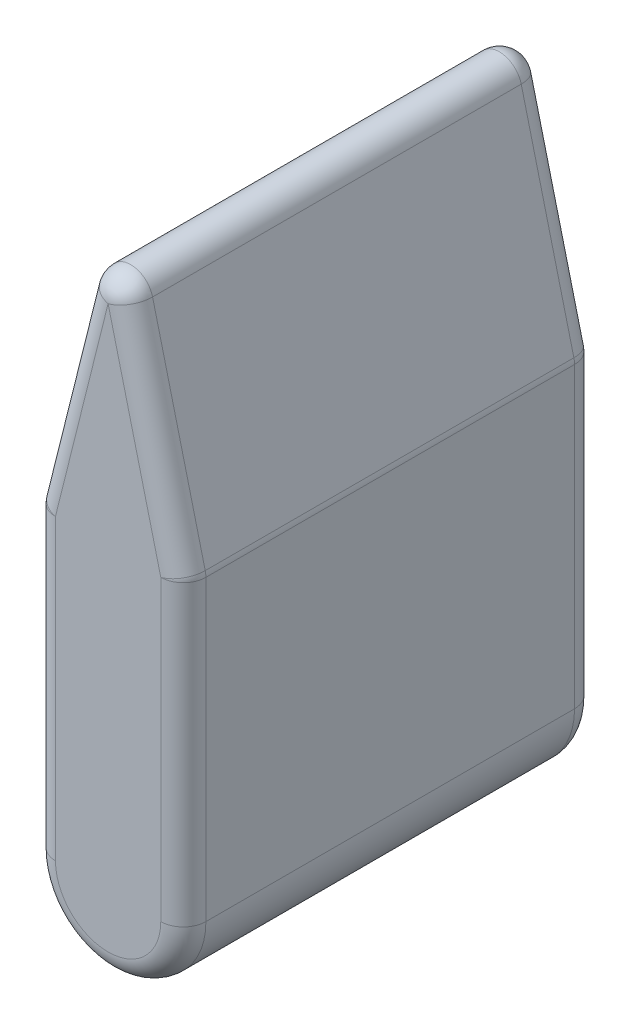
ISO-10303-21;
HEADER;
FILE_DESCRIPTION(('STEP AP214'),'2;1');
FILE_NAME('part.step','',(''),(''),'','','');
FILE_SCHEMA(('AUTOMOTIVE_DESIGN { 1 0 10303 214 1 1 1 1 }'));
ENDSEC;
DATA;
#1=APPLICATION_CONTEXT('core data for automotive mechanical design processes');
#2=APPLICATION_PROTOCOL_DEFINITION('international standard','automotive_design',2000,#1);
#3=PRODUCT_CONTEXT('',#1,'mechanical');
#4=PRODUCT('Part','Part','',(#3));
#5=PRODUCT_RELATED_PRODUCT_CATEGORY('part','',(#4));
#6=PRODUCT_DEFINITION_FORMATION('','',#4);
#7=PRODUCT_DEFINITION_CONTEXT('part definition',#1,'design');
#8=PRODUCT_DEFINITION('design','',#6,#7);
#9=PRODUCT_DEFINITION_SHAPE('','',#8);
#10=(LENGTH_UNIT() NAMED_UNIT(*) SI_UNIT(.MILLI.,.METRE.));
#11=(NAMED_UNIT(*) PLANE_ANGLE_UNIT() SI_UNIT($,.RADIAN.));
#12=(NAMED_UNIT(*) SI_UNIT($,.STERADIAN.) SOLID_ANGLE_UNIT());
#13=UNCERTAINTY_MEASURE_WITH_UNIT(LENGTH_MEASURE(1.E-05),#10,'distance_accuracy_value','');
#14=(GEOMETRIC_REPRESENTATION_CONTEXT(3) GLOBAL_UNCERTAINTY_ASSIGNED_CONTEXT((#13)) GLOBAL_UNIT_ASSIGNED_CONTEXT((#10,
#11,#12)) REPRESENTATION_CONTEXT('',''));
#15=CARTESIAN_POINT('',(0.,0.,0.));
#16=DIRECTION('',(0.,0.,1.));
#17=DIRECTION('',(1.,0.,0.));
#18=AXIS2_PLACEMENT_3D('',#15,#16,#17);
#19=CARTESIAN_POINT('',(0.,0.,27.5));
#20=DIRECTION('',(0.,0.,-1.));
#21=DIRECTION('',(-1.,0.,0.));
#22=AXIS2_PLACEMENT_3D('',#19,#20,#21);
#23=CYLINDRICAL_SURFACE('',#22,10.);
#24=DIRECTION('',(0.,0.,-1.));
#25=VECTOR('',#24,1.);
#26=CARTESIAN_POINT('',(-10.,0.,27.5));
#27=LINE('',#26,#25);
#28=CARTESIAN_POINT('',(-10.,0.,24.5));
#29=VERTEX_POINT('',#28);
#30=CARTESIAN_POINT('',(-10.,0.,-24.5));
#31=VERTEX_POINT('',#30);
#32=EDGE_CURVE('E163',#29,#31,#27,.T.);
#33=ORIENTED_EDGE('',*,*,#32,.T.);
#34=CARTESIAN_POINT('',(0.,0.,-24.5));
#35=DIRECTION('',(0.,0.,1.));
#36=DIRECTION('',(1.,0.,0.));
#37=AXIS2_PLACEMENT_3D('',#34,#35,#36);
#38=CIRCLE('',#37,10.);
#39=CARTESIAN_POINT('',(10.,0.,-24.5));
#40=VERTEX_POINT('',#39);
#41=EDGE_CURVE('E161',#31,#40,#38,.T.);
#42=ORIENTED_EDGE('',*,*,#41,.T.);
#43=DIRECTION('',(0.,0.,-1.));
#44=VECTOR('',#43,1.);
#45=CARTESIAN_POINT('',(10.,0.,27.5));
#46=LINE('',#45,#44);
#47=CARTESIAN_POINT('',(10.,0.,24.5));
#48=VERTEX_POINT('',#47);
#49=EDGE_CURVE('E144',#48,#40,#46,.T.);
#50=ORIENTED_EDGE('',*,*,#49,.F.);
#51=CARTESIAN_POINT('',(0.,0.,24.5));
#52=DIRECTION('',(0.,0.,1.));
#53=DIRECTION('',(1.,0.,0.));
#54=AXIS2_PLACEMENT_3D('',#51,#52,#53);
#55=CIRCLE('',#54,10.);
#56=EDGE_CURVE('E158',#48,#29,#55,.F.);
#57=ORIENTED_EDGE('',*,*,#56,.T.);
#58=EDGE_LOOP('',(#33,#42,#50,#57));
#59=FACE_BOUND('',#58,.T.);
#60=ADVANCED_FACE('F45',(#59),#23,.T.);
#61=CARTESIAN_POINT('',(9.99999999999999,40.,27.5));
#62=DIRECTION('',(-1.,0.,0.));
#63=DIRECTION('',(0.,-1.,0.));
#64=AXIS2_PLACEMENT_3D('',#61,#62,#63);
#65=PLANE('',#64);
#66=ORIENTED_EDGE('',*,*,#49,.T.);
#67=DIRECTION('',(0.,1.,0.));
#68=VECTOR('',#67,1.);
#69=CARTESIAN_POINT('',(9.99999999999999,40.,-24.5));
#70=LINE('',#69,#68);
#71=CARTESIAN_POINT('',(9.99999999999999,39.630683123147,-24.5));
#72=VERTEX_POINT('',#71);
#73=EDGE_CURVE('E153',#40,#72,#70,.T.);
#74=ORIENTED_EDGE('',*,*,#73,.T.);
#75=DIRECTION('',(0.,0.,-1.));
#76=VECTOR('',#75,1.);
#77=CARTESIAN_POINT('',(9.99999999999999,39.630683123147,27.5));
#78=LINE('',#77,#76);
#79=CARTESIAN_POINT('',(9.99999999999999,39.630683123147,24.5));
#80=VERTEX_POINT('',#79);
#81=EDGE_CURVE('E147',#72,#80,#78,.F.);
#82=ORIENTED_EDGE('',*,*,#81,.T.);
#83=DIRECTION('',(0.,1.,0.));
#84=VECTOR('',#83,1.);
#85=CARTESIAN_POINT('',(10.,0.,24.5));
#86=LINE('',#85,#84);
#87=EDGE_CURVE('E140',#80,#48,#86,.F.);
#88=ORIENTED_EDGE('',*,*,#87,.T.);
#89=EDGE_LOOP('',(#66,#74,#82,#88));
#90=FACE_BOUND('',#89,.T.);
#91=ADVANCED_FACE('F142',(#90),#65,.F.);
#92=CARTESIAN_POINT('',(0.,80.,27.5));
#93=DIRECTION('',(-0.970142500145332,-0.242535625036333,0.));
#94=DIRECTION('',(0.242535625036333,-0.970142500145332,0.));
#95=AXIS2_PLACEMENT_3D('',#92,#93,#94);
#96=PLANE('',#95);
#97=DIRECTION('',(-0.242535625036333,0.970142500145332,0.));
#98=VECTOR('',#97,1.);
#99=CARTESIAN_POINT('',(9.99999999999999,40.,24.5));
#100=LINE('',#99,#98);
#101=CARTESIAN_POINT('',(2.91042750043599,68.358289998256,24.5));
#102=VERTEX_POINT('',#101);
#103=CARTESIAN_POINT('',(9.91042750043599,40.358289998256,24.5));
#104=VERTEX_POINT('',#103);
#105=EDGE_CURVE('E232',#102,#104,#100,.F.);
#106=ORIENTED_EDGE('',*,*,#105,.T.);
#107=DIRECTION('',(0.,0.,-1.));
#108=VECTOR('',#107,1.);
#109=CARTESIAN_POINT('',(9.91042750043599,40.358289998256,27.5));
#110=LINE('',#109,#108);
#111=CARTESIAN_POINT('',(9.91042750043599,40.358289998256,-24.5));
#112=VERTEX_POINT('',#111);
#113=EDGE_CURVE('E239',#104,#112,#110,.T.);
#114=ORIENTED_EDGE('',*,*,#113,.T.);
#115=DIRECTION('',(-0.242535625036333,0.970142500145332,0.));
#116=VECTOR('',#115,1.);
#117=CARTESIAN_POINT('',(0.,80.,-24.5));
#118=LINE('',#117,#116);
#119=CARTESIAN_POINT('',(2.91042750043599,68.358289998256,-24.5));
#120=VERTEX_POINT('',#119);
#121=EDGE_CURVE('E235',#112,#120,#118,.T.);
#122=ORIENTED_EDGE('',*,*,#121,.T.);
#123=DIRECTION('',(0.,0.,-1.));
#124=VECTOR('',#123,1.);
#125=CARTESIAN_POINT('',(2.91042750043599,68.358289998256,27.5));
#126=LINE('',#125,#124);
#127=EDGE_CURVE('E229',#120,#102,#126,.F.);
#128=ORIENTED_EDGE('',*,*,#127,.T.);
#129=EDGE_LOOP('',(#106,#114,#122,#128));
#130=FACE_BOUND('',#129,.T.);
#131=ADVANCED_FACE('F342',(#130),#96,.F.);
#132=CARTESIAN_POINT('',(-10.,40.,27.5));
#133=DIRECTION('',(0.970142500145332,-0.242535625036333,0.));
#134=DIRECTION('',(0.242535625036333,0.970142500145332,0.));
#135=AXIS2_PLACEMENT_3D('',#132,#133,#134);
#136=PLANE('',#135);
#137=DIRECTION('',(-0.242535625036333,-0.970142500145332,0.));
#138=VECTOR('',#137,1.);
#139=CARTESIAN_POINT('',(-10.,40.,-24.5));
#140=LINE('',#139,#138);
#141=CARTESIAN_POINT('',(-2.910427500436,68.358289998256,-24.5));
#142=VERTEX_POINT('',#141);
#143=CARTESIAN_POINT('',(-9.91042750043601,40.358289998256,-24.5));
#144=VERTEX_POINT('',#143);
#145=EDGE_CURVE('E248',#142,#144,#140,.T.);
#146=ORIENTED_EDGE('',*,*,#145,.T.);
#147=DIRECTION('',(0.,0.,-1.));
#148=VECTOR('',#147,1.);
#149=CARTESIAN_POINT('',(-9.91042750043601,40.358289998256,27.5));
#150=LINE('',#149,#148);
#151=CARTESIAN_POINT('',(-9.91042750043601,40.358289998256,24.5));
#152=VERTEX_POINT('',#151);
#153=EDGE_CURVE('E252',#144,#152,#150,.F.);
#154=ORIENTED_EDGE('',*,*,#153,.T.);
#155=DIRECTION('',(-0.242535625036333,-0.970142500145332,0.));
#156=VECTOR('',#155,1.);
#157=CARTESIAN_POINT('',(0.,80.,24.5));
#158=LINE('',#157,#156);
#159=CARTESIAN_POINT('',(-2.910427500436,68.358289998256,24.5));
#160=VERTEX_POINT('',#159);
#161=EDGE_CURVE('E245',#152,#160,#158,.F.);
#162=ORIENTED_EDGE('',*,*,#161,.T.);
#163=DIRECTION('',(0.,0.,-1.));
#164=VECTOR('',#163,1.);
#165=CARTESIAN_POINT('',(-2.910427500436,68.358289998256,27.5));
#166=LINE('',#165,#164);
#167=EDGE_CURVE('E242',#160,#142,#166,.T.);
#168=ORIENTED_EDGE('',*,*,#167,.T.);
#169=EDGE_LOOP('',(#146,#154,#162,#168));
#170=FACE_BOUND('',#169,.T.);
#171=ADVANCED_FACE('F552',(#170),#136,.F.);
#172=CARTESIAN_POINT('',(-10.,0.,27.5));
#173=DIRECTION('',(1.,0.,0.));
#174=DIRECTION('',(0.,1.,0.));
#175=AXIS2_PLACEMENT_3D('',#172,#173,#174);
#176=PLANE('',#175);
#177=DIRECTION('',(0.,0.,-1.));
#178=VECTOR('',#177,1.);
#179=CARTESIAN_POINT('',(-10.,39.630683123147,27.5));
#180=LINE('',#179,#178);
#181=CARTESIAN_POINT('',(-10.,39.630683123147,24.5));
#182=VERTEX_POINT('',#181);
#183=CARTESIAN_POINT('',(-10.,39.630683123147,-24.5));
#184=VERTEX_POINT('',#183);
#185=EDGE_CURVE('E255',#182,#184,#180,.T.);
#186=ORIENTED_EDGE('',*,*,#185,.T.);
#187=DIRECTION('',(0.,-1.,0.));
#188=VECTOR('',#187,1.);
#189=CARTESIAN_POINT('',(-10.,0.,-24.5));
#190=LINE('',#189,#188);
#191=EDGE_CURVE('E174',#184,#31,#190,.T.);
#192=ORIENTED_EDGE('',*,*,#191,.T.);
#193=ORIENTED_EDGE('',*,*,#32,.F.);
#194=DIRECTION('',(0.,-1.,0.));
#195=VECTOR('',#194,1.);
#196=CARTESIAN_POINT('',(-10.,40.,24.5));
#197=LINE('',#196,#195);
#198=EDGE_CURVE('E258',#29,#182,#197,.F.);
#199=ORIENTED_EDGE('',*,*,#198,.T.);
#200=EDGE_LOOP('',(#186,#192,#193,#199));
#201=FACE_BOUND('',#200,.T.);
#202=ADVANCED_FACE('F544',(#201),#176,.F.);
#203=CARTESIAN_POINT('',(0.,0.,27.5));
#204=DIRECTION('',(0.,0.,1.));
#205=DIRECTION('',(1.,0.,0.));
#206=AXIS2_PLACEMENT_3D('',#203,#204,#205);
#207=PLANE('',#206);
#208=DIRECTION('',(-0.242535625036333,-0.970142500145332,0.));
#209=VECTOR('',#208,1.);
#210=CARTESIAN_POINT('',(-7.08957249956401,39.272393124891,27.5));
#211=LINE('',#210,#209);
#212=CARTESIAN_POINT('',(0.,67.630683123147,27.5));
#213=VERTEX_POINT('',#212);
#214=CARTESIAN_POINT('',(-7.00000000000001,39.630683123147,27.5));
#215=VERTEX_POINT('',#214);
#216=EDGE_CURVE('E55',#213,#215,#211,.T.);
#217=ORIENTED_EDGE('',*,*,#216,.T.);
#218=DIRECTION('',(0.,-1.,0.));
#219=VECTOR('',#218,1.);
#220=CARTESIAN_POINT('',(-7.,0.,27.5));
#221=LINE('',#220,#219);
#222=CARTESIAN_POINT('',(-7.,0.,27.5));
#223=VERTEX_POINT('',#222);
#224=EDGE_CURVE('E11',#215,#223,#221,.T.);
#225=ORIENTED_EDGE('',*,*,#224,.T.);
#226=CARTESIAN_POINT('',(0.,0.,27.5));
#227=DIRECTION('',(0.,0.,1.));
#228=DIRECTION('',(1.,0.,0.));
#229=AXIS2_PLACEMENT_3D('',#226,#227,#228);
#230=CIRCLE('',#229,7.);
#231=CARTESIAN_POINT('',(7.,0.,27.5));
#232=VERTEX_POINT('',#231);
#233=EDGE_CURVE('E265',#223,#232,#230,.T.);
#234=ORIENTED_EDGE('',*,*,#233,.T.);
#235=DIRECTION('',(0.,1.,0.));
#236=VECTOR('',#235,1.);
#237=CARTESIAN_POINT('',(6.99999999999999,40.,27.5));
#238=LINE('',#237,#236);
#239=CARTESIAN_POINT('',(6.99999999999999,39.630683123147,27.5));
#240=VERTEX_POINT('',#239);
#241=EDGE_CURVE('E177',#232,#240,#238,.T.);
#242=ORIENTED_EDGE('',*,*,#241,.T.);
#243=DIRECTION('',(-0.242535625036333,0.970142500145332,0.));
#244=VECTOR('',#243,1.);
#245=CARTESIAN_POINT('',(-2.910427500436,79.272393124891,27.5));
#246=LINE('',#245,#244);
#247=EDGE_CURVE('E66',#240,#213,#246,.T.);
#248=ORIENTED_EDGE('',*,*,#247,.T.);
#249=EDGE_LOOP('',(#217,#225,#234,#242,#248));
#250=FACE_BOUND('',#249,.T.);
#251=ADVANCED_FACE('F536',(#250),#207,.T.);
#252=CARTESIAN_POINT('',(0.,0.,-27.5));
#253=DIRECTION('',(0.,0.,1.));
#254=DIRECTION('',(1.,0.,0.));
#255=AXIS2_PLACEMENT_3D('',#252,#253,#254);
#256=PLANE('',#255);
#257=DIRECTION('',(-0.242535625036333,0.970142500145332,0.));
#258=VECTOR('',#257,1.);
#259=CARTESIAN_POINT('',(15.9131019113287,3.97827547783217,-27.5));
#260=LINE('',#259,#258);
#261=CARTESIAN_POINT('',(0.,67.630683123147,-27.5));
#262=VERTEX_POINT('',#261);
#263=CARTESIAN_POINT('',(7.,39.630683123147,-27.5));
#264=VERTEX_POINT('',#263);
#265=EDGE_CURVE('E222',#262,#264,#260,.F.);
#266=ORIENTED_EDGE('',*,*,#265,.T.);
#267=DIRECTION('',(0.,1.,0.));
#268=VECTOR('',#267,1.);
#269=CARTESIAN_POINT('',(7.,0.,-27.5));
#270=LINE('',#269,#268);
#271=CARTESIAN_POINT('',(7.,0.,-27.5));
#272=VERTEX_POINT('',#271);
#273=EDGE_CURVE('E225',#264,#272,#270,.F.);
#274=ORIENTED_EDGE('',*,*,#273,.T.);
#275=CARTESIAN_POINT('',(0.,0.,-27.5));
#276=DIRECTION('',(0.,0.,1.));
#277=DIRECTION('',(1.,0.,0.));
#278=AXIS2_PLACEMENT_3D('',#275,#276,#277);
#279=CIRCLE('',#278,7.);
#280=CARTESIAN_POINT('',(-7.,0.,-27.5));
#281=VERTEX_POINT('',#280);
#282=EDGE_CURVE('E213',#272,#281,#279,.F.);
#283=ORIENTED_EDGE('',*,*,#282,.T.);
#284=DIRECTION('',(0.,-1.,0.));
#285=VECTOR('',#284,1.);
#286=CARTESIAN_POINT('',(-7.,0.,-27.5));
#287=LINE('',#286,#285);
#288=CARTESIAN_POINT('',(-7.00000000000001,39.630683123147,-27.5));
#289=VERTEX_POINT('',#288);
#290=EDGE_CURVE('E216',#281,#289,#287,.F.);
#291=ORIENTED_EDGE('',*,*,#290,.T.);
#292=DIRECTION('',(-0.242535625036333,-0.970142500145332,0.));
#293=VECTOR('',#292,1.);
#294=CARTESIAN_POINT('',(-15.9131019113287,3.97827547783219,-27.5));
#295=LINE('',#294,#293);
#296=EDGE_CURVE('E219',#289,#262,#295,.F.);
#297=ORIENTED_EDGE('',*,*,#296,.T.);
#298=EDGE_LOOP('',(#266,#274,#283,#291,#297));
#299=FACE_BOUND('',#298,.T.);
#300=ADVANCED_FACE('F362',(#299),#256,.F.);
#301=CARTESIAN_POINT('',(-7.,0.,24.5));
#302=DIRECTION('',(0.,1.,0.));
#303=DIRECTION('',(-1.,0.,0.));
#304=AXIS2_PLACEMENT_3D('',#301,#302,#303);
#305=CYLINDRICAL_SURFACE('',#304,3.);
#306=CARTESIAN_POINT('',(-7.,0.,24.5));
#307=DIRECTION('',(0.,-1.,0.));
#308=DIRECTION('',(1.,0.,0.));
#309=AXIS2_PLACEMENT_3D('',#306,#307,#308);
#310=CIRCLE('',#309,3.);
#311=EDGE_CURVE('E172',#223,#29,#310,.T.);
#312=ORIENTED_EDGE('',*,*,#311,.F.);
#313=ORIENTED_EDGE('',*,*,#224,.F.);
#314=CARTESIAN_POINT('',(-7.00000000000001,39.630683123147,24.5));
#315=DIRECTION('',(0.,1.,0.));
#316=DIRECTION('',(0.,0.,1.));
#317=AXIS2_PLACEMENT_3D('',#314,#315,#316);
#318=CIRCLE('',#317,3.);
#319=EDGE_CURVE('E196',#182,#215,#318,.T.);
#320=ORIENTED_EDGE('',*,*,#319,.F.);
#321=ORIENTED_EDGE('',*,*,#198,.F.);
#322=EDGE_LOOP('',(#312,#313,#320,#321));
#323=FACE_BOUND('',#322,.T.);
#324=ADVANCED_FACE('F47',(#323),#305,.T.);
#325=CARTESIAN_POINT('',(-15.9131019113287,3.97827547783219,24.5));
#326=DIRECTION('',(0.242535625036333,0.970142500145332,0.));
#327=DIRECTION('',(-0.970142500145332,0.242535625036333,0.));
#328=AXIS2_PLACEMENT_3D('',#325,#326,#327);
#329=CYLINDRICAL_SURFACE('',#328,3.);
#330=CARTESIAN_POINT('',(-7.00000000000001,39.630683123147,24.5));
#331=DIRECTION('',(-0.242535625036333,-0.970142500145332,0.));
#332=DIRECTION('',(0.970142500145332,-0.242535625036333,0.));
#333=AXIS2_PLACEMENT_3D('',#330,#331,#332);
#334=CIRCLE('',#333,3.);
#335=EDGE_CURVE('E49',#215,#152,#334,.T.);
#336=ORIENTED_EDGE('',*,*,#335,.F.);
#337=ORIENTED_EDGE('',*,*,#216,.F.);
#338=CARTESIAN_POINT('',(0.,67.630683123147,24.5));
#339=DIRECTION('',(0.242535625036335,0.970142500145331,0.));
#340=DIRECTION('',(-0.970142500145332,0.242535625036335,0.));
#341=AXIS2_PLACEMENT_3D('',#338,#339,#340);
#342=CIRCLE('',#341,3.);
#343=EDGE_CURVE('E185',#160,#213,#342,.T.);
#344=ORIENTED_EDGE('',*,*,#343,.F.);
#345=ORIENTED_EDGE('',*,*,#161,.F.);
#346=EDGE_LOOP('',(#336,#337,#344,#345));
#347=FACE_BOUND('',#346,.T.);
#348=ADVANCED_FACE('F514',(#347),#329,.T.);
#349=CARTESIAN_POINT('',(-7.00000000000001,39.630683123147,24.5));
#350=DIRECTION('',(0.,0.,1.));
#351=DIRECTION('',(0.,-1.,0.));
#352=AXIS2_PLACEMENT_3D('',#349,#350,#351);
#353=SPHERICAL_SURFACE('',#352,3.);
#354=ORIENTED_EDGE('',*,*,#319,.T.);
#355=ORIENTED_EDGE('',*,*,#335,.T.);
#356=CARTESIAN_POINT('',(-7.00000000000001,39.630683123147,24.5));
#357=DIRECTION('',(0.,0.,1.));
#358=DIRECTION('',(1.,0.,0.));
#359=AXIS2_PLACEMENT_3D('',#356,#357,#358);
#360=CIRCLE('',#359,3.);
#361=EDGE_CURVE('E179',#182,#152,#360,.F.);
#362=ORIENTED_EDGE('',*,*,#361,.F.);
#363=EDGE_LOOP('',(#354,#355,#362));
#364=FACE_BOUND('',#363,.T.);
#365=ADVANCED_FACE('F506',(#364),#353,.T.);
#366=CARTESIAN_POINT('',(0.,0.,24.5));
#367=DIRECTION('',(0.,0.,1.));
#368=DIRECTION('',(1.,0.,0.));
#369=AXIS2_PLACEMENT_3D('',#366,#367,#368);
#370=TOROIDAL_SURFACE('',#369,7.,3.);
#371=ORIENTED_EDGE('',*,*,#311,.T.);
#372=ORIENTED_EDGE('',*,*,#56,.F.);
#373=CARTESIAN_POINT('',(7.,0.,24.5));
#374=DIRECTION('',(0.,1.,0.));
#375=DIRECTION('',(-1.,0.,0.));
#376=AXIS2_PLACEMENT_3D('',#373,#374,#375);
#377=CIRCLE('',#376,3.);
#378=EDGE_CURVE('E169',#232,#48,#377,.T.);
#379=ORIENTED_EDGE('',*,*,#378,.F.);
#380=ORIENTED_EDGE('',*,*,#233,.F.);
#381=EDGE_LOOP('',(#371,#372,#379,#380));
#382=FACE_BOUND('',#381,.T.);
#383=ADVANCED_FACE('F168',(#382),#370,.T.);
#384=CARTESIAN_POINT('',(0.,67.630683123147,24.5));
#385=DIRECTION('',(0.,0.,1.));
#386=DIRECTION('',(1.,0.,0.));
#387=AXIS2_PLACEMENT_3D('',#384,#385,#386);
#388=SPHERICAL_SURFACE('',#387,3.);
#389=CARTESIAN_POINT('',(0.,67.630683123147,24.5));
#390=DIRECTION('',(0.,0.,1.));
#391=DIRECTION('',(1.,0.,0.));
#392=AXIS2_PLACEMENT_3D('',#389,#390,#391);
#393=CIRCLE('',#392,3.);
#394=EDGE_CURVE('E188',#160,#102,#393,.F.);
#395=ORIENTED_EDGE('',*,*,#394,.F.);
#396=ORIENTED_EDGE('',*,*,#343,.T.);
#397=CARTESIAN_POINT('',(0.,67.630683123147,24.5));
#398=DIRECTION('',(-0.242535625036335,0.970142500145331,0.));
#399=DIRECTION('',(-0.970142500145332,-0.242535625036335,0.));
#400=AXIS2_PLACEMENT_3D('',#397,#398,#399);
#401=CIRCLE('',#400,3.);
#402=EDGE_CURVE('E180',#102,#213,#401,.F.);
#403=ORIENTED_EDGE('',*,*,#402,.F.);
#404=EDGE_LOOP('',(#395,#396,#403));
#405=FACE_BOUND('',#404,.T.);
#406=ADVANCED_FACE('F335',(#405),#388,.T.);
#407=CARTESIAN_POINT('',(-7.00000000000001,39.630683123147,27.5));
#408=DIRECTION('',(0.,0.,-1.));
#409=DIRECTION('',(-1.,0.,0.));
#410=AXIS2_PLACEMENT_3D('',#407,#408,#409);
#411=CYLINDRICAL_SURFACE('',#410,3.);
#412=ORIENTED_EDGE('',*,*,#361,.T.);
#413=ORIENTED_EDGE('',*,*,#153,.F.);
#414=CARTESIAN_POINT('',(-7.00000000000001,39.630683123147,-24.5));
#415=DIRECTION('',(0.,0.,-1.));
#416=DIRECTION('',(-1.,0.,0.));
#417=AXIS2_PLACEMENT_3D('',#414,#415,#416);
#418=CIRCLE('',#417,3.);
#419=EDGE_CURVE('E318',#184,#144,#418,.T.);
#420=ORIENTED_EDGE('',*,*,#419,.F.);
#421=ORIENTED_EDGE('',*,*,#185,.F.);
#422=EDGE_LOOP('',(#412,#413,#420,#421));
#423=FACE_BOUND('',#422,.T.);
#424=ADVANCED_FACE('F483',(#423),#411,.T.);
#425=CARTESIAN_POINT('',(7.,0.,24.5));
#426=DIRECTION('',(0.,-1.,0.));
#427=DIRECTION('',(1.,0.,0.));
#428=AXIS2_PLACEMENT_3D('',#425,#426,#427);
#429=CYLINDRICAL_SURFACE('',#428,3.);
#430=ORIENTED_EDGE('',*,*,#378,.T.);
#431=ORIENTED_EDGE('',*,*,#87,.F.);
#432=CARTESIAN_POINT('',(6.99999999999999,39.630683123147,24.5));
#433=DIRECTION('',(0.,1.,0.));
#434=DIRECTION('',(-1.,0.,0.));
#435=AXIS2_PLACEMENT_3D('',#432,#433,#434);
#436=CIRCLE('',#435,3.);
#437=EDGE_CURVE('E315',#240,#80,#436,.T.);
#438=ORIENTED_EDGE('',*,*,#437,.F.);
#439=ORIENTED_EDGE('',*,*,#241,.F.);
#440=EDGE_LOOP('',(#430,#431,#438,#439));
#441=FACE_BOUND('',#440,.T.);
#442=ADVANCED_FACE('F176',(#441),#429,.T.);
#443=CARTESIAN_POINT('',(15.9131019113287,3.97827547783217,24.5));
#444=DIRECTION('',(0.242535625036333,-0.970142500145332,0.));
#445=DIRECTION('',(0.970142500145332,0.242535625036333,0.));
#446=AXIS2_PLACEMENT_3D('',#443,#444,#445);
#447=CYLINDRICAL_SURFACE('',#446,3.);
#448=ORIENTED_EDGE('',*,*,#402,.T.);
#449=ORIENTED_EDGE('',*,*,#247,.F.);
#450=CARTESIAN_POINT('',(7.,39.630683123147,24.5));
#451=DIRECTION('',(0.242535625036333,-0.970142500145332,0.));
#452=DIRECTION('',(0.970142500145332,0.242535625036333,0.));
#453=AXIS2_PLACEMENT_3D('',#450,#451,#452);
#454=CIRCLE('',#453,3.);
#455=EDGE_CURVE('E311',#104,#240,#454,.T.);
#456=ORIENTED_EDGE('',*,*,#455,.F.);
#457=ORIENTED_EDGE('',*,*,#105,.F.);
#458=EDGE_LOOP('',(#448,#449,#456,#457));
#459=FACE_BOUND('',#458,.T.);
#460=ADVANCED_FACE('F339',(#459),#447,.T.);
#461=CARTESIAN_POINT('',(0.,67.630683123147,27.5));
#462=DIRECTION('',(0.,0.,-1.));
#463=DIRECTION('',(-1.,0.,0.));
#464=AXIS2_PLACEMENT_3D('',#461,#462,#463);
#465=CYLINDRICAL_SURFACE('',#464,3.);
#466=ORIENTED_EDGE('',*,*,#394,.T.);
#467=ORIENTED_EDGE('',*,*,#127,.F.);
#468=CARTESIAN_POINT('',(0.,67.630683123147,-24.5));
#469=DIRECTION('',(0.,0.,-1.));
#470=DIRECTION('',(-1.,0.,0.));
#471=AXIS2_PLACEMENT_3D('',#468,#469,#470);
#472=CIRCLE('',#471,3.);
#473=EDGE_CURVE('E307',#142,#120,#472,.T.);
#474=ORIENTED_EDGE('',*,*,#473,.F.);
#475=ORIENTED_EDGE('',*,*,#167,.F.);
#476=EDGE_LOOP('',(#466,#467,#474,#475));
#477=FACE_BOUND('',#476,.T.);
#478=ADVANCED_FACE('F331',(#477),#465,.T.);
#479=CARTESIAN_POINT('',(-7.08957249956401,39.272393124891,-24.5));
#480=DIRECTION('',(-0.242535625036333,-0.970142500145332,0.));
#481=DIRECTION('',(0.970142500145332,-0.242535625036333,0.));
#482=AXIS2_PLACEMENT_3D('',#479,#480,#481);
#483=CYLINDRICAL_SURFACE('',#482,3.);
#484=CARTESIAN_POINT('',(-7.00000000000001,39.630683123147,-24.5));
#485=DIRECTION('',(-0.242535625036333,-0.970142500145332,0.));
#486=DIRECTION('',(0.970142500145332,-0.242535625036333,0.));
#487=AXIS2_PLACEMENT_3D('',#484,#485,#486);
#488=CIRCLE('',#487,3.);
#489=EDGE_CURVE('E321',#144,#289,#488,.T.);
#490=ORIENTED_EDGE('',*,*,#489,.F.);
#491=ORIENTED_EDGE('',*,*,#145,.F.);
#492=CARTESIAN_POINT('',(0.,67.630683123147,-24.5));
#493=DIRECTION('',(0.242535625036335,0.970142500145331,0.));
#494=DIRECTION('',(-0.970142500145331,0.242535625036335,0.));
#495=AXIS2_PLACEMENT_3D('',#492,#493,#494);
#496=CIRCLE('',#495,3.);
#497=EDGE_CURVE('E303',#262,#142,#496,.T.);
#498=ORIENTED_EDGE('',*,*,#497,.F.);
#499=ORIENTED_EDGE('',*,*,#296,.F.);
#500=EDGE_LOOP('',(#490,#491,#498,#499));
#501=FACE_BOUND('',#500,.T.);
#502=ADVANCED_FACE('F369',(#501),#483,.T.);
#503=CARTESIAN_POINT('',(-7.00000000000001,39.630683123147,-24.5));
#504=DIRECTION('',(0.,0.,-1.));
#505=DIRECTION('',(-1.,0.,0.));
#506=AXIS2_PLACEMENT_3D('',#503,#504,#505);
#507=SPHERICAL_SURFACE('',#506,3.);
#508=ORIENTED_EDGE('',*,*,#419,.T.);
#509=ORIENTED_EDGE('',*,*,#489,.T.);
#510=CARTESIAN_POINT('',(-7.00000000000001,39.630683123147,-24.5));
#511=DIRECTION('',(0.,1.,0.));
#512=DIRECTION('',(-1.,0.,0.));
#513=AXIS2_PLACEMENT_3D('',#510,#511,#512);
#514=CIRCLE('',#513,3.);
#515=EDGE_CURVE('E299',#184,#289,#514,.F.);
#516=ORIENTED_EDGE('',*,*,#515,.F.);
#517=EDGE_LOOP('',(#508,#509,#516));
#518=FACE_BOUND('',#517,.T.);
#519=ADVANCED_FACE('F382',(#518),#507,.T.);
#520=CARTESIAN_POINT('',(6.99999999999999,39.630683123147,24.5));
#521=DIRECTION('',(0.,0.,1.));
#522=DIRECTION('',(0.,-1.,0.));
#523=AXIS2_PLACEMENT_3D('',#520,#521,#522);
#524=SPHERICAL_SURFACE('',#523,3.);
#525=ORIENTED_EDGE('',*,*,#455,.T.);
#526=ORIENTED_EDGE('',*,*,#437,.T.);
#527=CARTESIAN_POINT('',(6.99999999999999,39.630683123147,24.5));
#528=DIRECTION('',(0.,0.,1.));
#529=DIRECTION('',(1.,0.,0.));
#530=AXIS2_PLACEMENT_3D('',#527,#528,#529);
#531=CIRCLE('',#530,3.);
#532=EDGE_CURVE('E295',#104,#80,#531,.F.);
#533=ORIENTED_EDGE('',*,*,#532,.F.);
#534=EDGE_LOOP('',(#525,#526,#533));
#535=FACE_BOUND('',#534,.T.);
#536=ADVANCED_FACE('F374',(#535),#524,.T.);
#537=CARTESIAN_POINT('',(0.,67.630683123147,-24.5));
#538=DIRECTION('',(0.,0.,-1.));
#539=DIRECTION('',(0.,1.,0.));
#540=AXIS2_PLACEMENT_3D('',#537,#538,#539);
#541=SPHERICAL_SURFACE('',#540,3.);
#542=ORIENTED_EDGE('',*,*,#497,.T.);
#543=ORIENTED_EDGE('',*,*,#473,.T.);
#544=CARTESIAN_POINT('',(0.,67.630683123147,-24.5));
#545=DIRECTION('',(-0.242535625036335,0.970142500145332,0.));
#546=DIRECTION('',(-0.970142500145332,-0.242535625036335,0.));
#547=AXIS2_PLACEMENT_3D('',#544,#545,#546);
#548=CIRCLE('',#547,3.);
#549=EDGE_CURVE('E292',#262,#120,#548,.F.);
#550=ORIENTED_EDGE('',*,*,#549,.F.);
#551=EDGE_LOOP('',(#542,#543,#550));
#552=FACE_BOUND('',#551,.T.);
#553=ADVANCED_FACE('F371',(#552),#541,.T.);
#554=CARTESIAN_POINT('',(-7.,0.,-24.5));
#555=DIRECTION('',(0.,-1.,0.));
#556=DIRECTION('',(1.,0.,0.));
#557=AXIS2_PLACEMENT_3D('',#554,#555,#556);
#558=CYLINDRICAL_SURFACE('',#557,3.);
#559=ORIENTED_EDGE('',*,*,#515,.T.);
#560=ORIENTED_EDGE('',*,*,#290,.F.);
#561=CARTESIAN_POINT('',(-7.,0.,-24.5));
#562=DIRECTION('',(0.,-1.,0.));
#563=DIRECTION('',(1.,0.,0.));
#564=AXIS2_PLACEMENT_3D('',#561,#562,#563);
#565=CIRCLE('',#564,3.);
#566=EDGE_CURVE('E288',#31,#281,#565,.T.);
#567=ORIENTED_EDGE('',*,*,#566,.F.);
#568=ORIENTED_EDGE('',*,*,#191,.F.);
#569=EDGE_LOOP('',(#559,#560,#567,#568));
#570=FACE_BOUND('',#569,.T.);
#571=ADVANCED_FACE('F373',(#570),#558,.T.);
#572=CARTESIAN_POINT('',(6.99999999999999,39.630683123147,27.5));
#573=DIRECTION('',(0.,0.,-1.));
#574=DIRECTION('',(-1.,0.,0.));
#575=AXIS2_PLACEMENT_3D('',#572,#573,#574);
#576=CYLINDRICAL_SURFACE('',#575,3.);
#577=ORIENTED_EDGE('',*,*,#532,.T.);
#578=ORIENTED_EDGE('',*,*,#81,.F.);
#579=CARTESIAN_POINT('',(7.,39.630683123147,-24.5));
#580=DIRECTION('',(0.,0.,-1.));
#581=DIRECTION('',(-1.,0.,0.));
#582=AXIS2_PLACEMENT_3D('',#579,#580,#581);
#583=CIRCLE('',#582,3.);
#584=EDGE_CURVE('E284',#112,#72,#583,.T.);
#585=ORIENTED_EDGE('',*,*,#584,.F.);
#586=ORIENTED_EDGE('',*,*,#113,.F.);
#587=EDGE_LOOP('',(#577,#578,#585,#586));
#588=FACE_BOUND('',#587,.T.);
#589=ADVANCED_FACE('F353',(#588),#576,.T.);
#590=CARTESIAN_POINT('',(-2.910427500436,79.272393124891,-24.5));
#591=DIRECTION('',(-0.242535625036333,0.970142500145332,0.));
#592=DIRECTION('',(-0.970142500145332,-0.242535625036333,0.));
#593=AXIS2_PLACEMENT_3D('',#590,#591,#592);
#594=CYLINDRICAL_SURFACE('',#593,3.);
#595=ORIENTED_EDGE('',*,*,#549,.T.);
#596=ORIENTED_EDGE('',*,*,#121,.F.);
#597=CARTESIAN_POINT('',(7.,39.630683123147,-24.5));
#598=DIRECTION('',(0.242535625036335,-0.970142500145331,0.));
#599=DIRECTION('',(0.970142500145331,0.242535625036335,0.));
#600=AXIS2_PLACEMENT_3D('',#597,#598,#599);
#601=CIRCLE('',#600,3.);
#602=EDGE_CURVE('E280',#264,#112,#601,.T.);
#603=ORIENTED_EDGE('',*,*,#602,.F.);
#604=ORIENTED_EDGE('',*,*,#265,.F.);
#605=EDGE_LOOP('',(#595,#596,#603,#604));
#606=FACE_BOUND('',#605,.T.);
#607=ADVANCED_FACE('F348',(#606),#594,.T.);
#608=CARTESIAN_POINT('',(0.,0.,-24.5));
#609=DIRECTION('',(0.,0.,1.));
#610=DIRECTION('',(1.,0.,0.));
#611=AXIS2_PLACEMENT_3D('',#608,#609,#610);
#612=TOROIDAL_SURFACE('',#611,7.,3.);
#613=ORIENTED_EDGE('',*,*,#566,.T.);
#614=ORIENTED_EDGE('',*,*,#282,.F.);
#615=CARTESIAN_POINT('',(7.,0.,-24.5));
#616=DIRECTION('',(0.,1.,0.));
#617=DIRECTION('',(0.,0.,1.));
#618=AXIS2_PLACEMENT_3D('',#615,#616,#617);
#619=CIRCLE('',#618,3.);
#620=EDGE_CURVE('E277',#40,#272,#619,.T.);
#621=ORIENTED_EDGE('',*,*,#620,.F.);
#622=ORIENTED_EDGE('',*,*,#41,.F.);
#623=EDGE_LOOP('',(#613,#614,#621,#622));
#624=FACE_BOUND('',#623,.T.);
#625=ADVANCED_FACE('F397',(#624),#612,.T.);
#626=CARTESIAN_POINT('',(6.99999999999999,39.630683123147,-24.5));
#627=DIRECTION('',(0.,0.,-1.));
#628=DIRECTION('',(-1.,0.,0.));
#629=AXIS2_PLACEMENT_3D('',#626,#627,#628);
#630=SPHERICAL_SURFACE('',#629,3.);
#631=ORIENTED_EDGE('',*,*,#602,.T.);
#632=ORIENTED_EDGE('',*,*,#584,.T.);
#633=CARTESIAN_POINT('',(6.99999999999999,39.630683123147,-24.5));
#634=DIRECTION('',(0.,1.,0.));
#635=DIRECTION('',(0.,0.,1.));
#636=AXIS2_PLACEMENT_3D('',#633,#634,#635);
#637=CIRCLE('',#636,3.);
#638=EDGE_CURVE('E274',#264,#72,#637,.F.);
#639=ORIENTED_EDGE('',*,*,#638,.F.);
#640=EDGE_LOOP('',(#631,#632,#639));
#641=FACE_BOUND('',#640,.T.);
#642=ADVANCED_FACE('F356',(#641),#630,.T.);
#643=CARTESIAN_POINT('',(6.99999999999999,40.,-24.5));
#644=DIRECTION('',(0.,1.,0.));
#645=DIRECTION('',(-1.,0.,0.));
#646=AXIS2_PLACEMENT_3D('',#643,#644,#645);
#647=CYLINDRICAL_SURFACE('',#646,3.);
#648=ORIENTED_EDGE('',*,*,#620,.T.);
#649=ORIENTED_EDGE('',*,*,#273,.F.);
#650=ORIENTED_EDGE('',*,*,#638,.T.);
#651=ORIENTED_EDGE('',*,*,#73,.F.);
#652=EDGE_LOOP('',(#648,#649,#650,#651));
#653=FACE_BOUND('',#652,.T.);
#654=ADVANCED_FACE('F359',(#653),#647,.T.);
#655=CLOSED_SHELL('',(#60,#91,#131,#171,#202,#251,#300,#324,#348,#365,#383,#406,#424,#442,#460,
#478,#502,#519,#536,#553,#571,#589,#607,#625,#642,#654));
#656=MANIFOLD_SOLID_BREP('B2',#655);
#657=ADVANCED_BREP_SHAPE_REPRESENTATION('',(#18,#656),#14);
#658=SHAPE_DEFINITION_REPRESENTATION(#9,#657);
ENDSEC;
END-ISO-10303-21;
